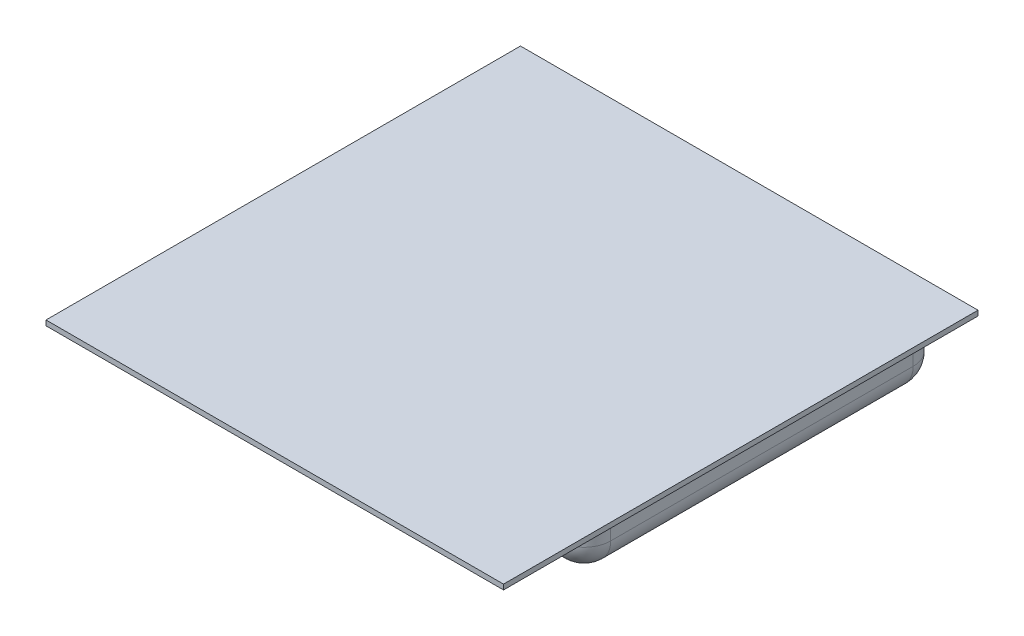
ISO-10303-21;
HEADER;
FILE_DESCRIPTION(('STEP AP214'),'2;1');
FILE_NAME('part.step','',(''),(''),'','','');
FILE_SCHEMA(('AUTOMOTIVE_DESIGN { 1 0 10303 214 1 1 1 1 }'));
ENDSEC;
DATA;
#1=APPLICATION_CONTEXT('core data for automotive mechanical design processes');
#2=APPLICATION_PROTOCOL_DEFINITION('international standard','automotive_design',2000,#1);
#3=PRODUCT_CONTEXT('',#1,'mechanical');
#4=PRODUCT('Part','Part','',(#3));
#5=PRODUCT_RELATED_PRODUCT_CATEGORY('part','',(#4));
#6=PRODUCT_DEFINITION_FORMATION('','',#4);
#7=PRODUCT_DEFINITION_CONTEXT('part definition',#1,'design');
#8=PRODUCT_DEFINITION('design','',#6,#7);
#9=PRODUCT_DEFINITION_SHAPE('','',#8);
#10=(LENGTH_UNIT() NAMED_UNIT(*) SI_UNIT(.MILLI.,.METRE.));
#11=(NAMED_UNIT(*) PLANE_ANGLE_UNIT() SI_UNIT($,.RADIAN.));
#12=(NAMED_UNIT(*) SI_UNIT($,.STERADIAN.) SOLID_ANGLE_UNIT());
#13=UNCERTAINTY_MEASURE_WITH_UNIT(LENGTH_MEASURE(1.E-05),#10,'distance_accuracy_value','');
#14=(GEOMETRIC_REPRESENTATION_CONTEXT(3) GLOBAL_UNCERTAINTY_ASSIGNED_CONTEXT((#13)) GLOBAL_UNIT_ASSIGNED_CONTEXT((#10,
#11,#12)) REPRESENTATION_CONTEXT('',''));
#15=CARTESIAN_POINT('',(0.,0.,0.));
#16=DIRECTION('',(0.,0.,1.));
#17=DIRECTION('',(1.,0.,0.));
#18=AXIS2_PLACEMENT_3D('',#15,#16,#17);
#19=CARTESIAN_POINT('',(-85.725,0.,88.9));
#20=DIRECTION('',(0.,1.,0.));
#21=DIRECTION('',(0.,0.,1.));
#22=AXIS2_PLACEMENT_3D('',#19,#20,#21);
#23=PLANE('',#22);
#24=DIRECTION('',(1.,0.,0.));
#25=VECTOR('',#24,1.);
#26=CARTESIAN_POINT('',(-85.725,0.,-88.9));
#27=LINE('',#26,#25);
#28=CARTESIAN_POINT('',(-85.725,0.,-88.9));
#29=VERTEX_POINT('',#28);
#30=CARTESIAN_POINT('',(85.725,0.,-88.9));
#31=VERTEX_POINT('',#30);
#32=EDGE_CURVE('E282',#29,#31,#27,.T.);
#33=ORIENTED_EDGE('',*,*,#32,.T.);
#34=DIRECTION('',(0.,0.,-1.));
#35=VECTOR('',#34,1.);
#36=CARTESIAN_POINT('',(85.725,0.,88.9));
#37=LINE('',#36,#35);
#38=CARTESIAN_POINT('',(85.725,0.,88.9));
#39=VERTEX_POINT('',#38);
#40=EDGE_CURVE('E152',#39,#31,#37,.T.);
#41=ORIENTED_EDGE('',*,*,#40,.F.);
#42=DIRECTION('',(1.,0.,0.));
#43=VECTOR('',#42,1.);
#44=CARTESIAN_POINT('',(-85.725,0.,88.9));
#45=LINE('',#44,#43);
#46=CARTESIAN_POINT('',(-85.725,0.,88.9));
#47=VERTEX_POINT('',#46);
#48=EDGE_CURVE('E145',#47,#39,#45,.T.);
#49=ORIENTED_EDGE('',*,*,#48,.F.);
#50=DIRECTION('',(0.,0.,-1.));
#51=VECTOR('',#50,1.);
#52=CARTESIAN_POINT('',(-85.725,0.,88.9));
#53=LINE('',#52,#51);
#54=EDGE_CURVE('E149',#47,#29,#53,.T.);
#55=ORIENTED_EDGE('',*,*,#54,.T.);
#56=EDGE_LOOP('',(#33,#41,#49,#55));
#57=FACE_BOUND('',#56,.T.);
#58=DIRECTION('',(0.,0.,-1.));
#59=VECTOR('',#58,1.);
#60=CARTESIAN_POINT('',(-77.7875,0.,50.8));
#61=LINE('',#60,#59);
#62=CARTESIAN_POINT('',(-77.7875,0.,40.8));
#63=VERTEX_POINT('',#62);
#64=CARTESIAN_POINT('',(-77.7875,0.,-72.55));
#65=VERTEX_POINT('',#64);
#66=EDGE_CURVE('E259',#63,#65,#61,.T.);
#67=ORIENTED_EDGE('',*,*,#66,.F.);
#68=CARTESIAN_POINT('',(-67.7875,0.,40.8));
#69=DIRECTION('',(0.,1.,0.));
#70=DIRECTION('',(0.,0.,1.));
#71=AXIS2_PLACEMENT_3D('',#68,#69,#70);
#72=CIRCLE('',#71,10.);
#73=CARTESIAN_POINT('',(-67.7875,0.,50.8));
#74=VERTEX_POINT('',#73);
#75=EDGE_CURVE('E202',#63,#74,#72,.T.);
#76=ORIENTED_EDGE('',*,*,#75,.T.);
#77=DIRECTION('',(-1.,0.,0.));
#78=VECTOR('',#77,1.);
#79=CARTESIAN_POINT('',(-77.7875,0.,50.8));
#80=LINE('',#79,#78);
#81=CARTESIAN_POINT('',(67.7875,0.,50.8));
#82=VERTEX_POINT('',#81);
#83=EDGE_CURVE('E275',#82,#74,#80,.T.);
#84=ORIENTED_EDGE('',*,*,#83,.F.);
#85=CARTESIAN_POINT('',(67.7875,0.,40.8));
#86=DIRECTION('',(0.,1.,0.));
#87=DIRECTION('',(0.,0.,1.));
#88=AXIS2_PLACEMENT_3D('',#85,#86,#87);
#89=CIRCLE('',#88,10.);
#90=CARTESIAN_POINT('',(77.7875,0.,40.8));
#91=VERTEX_POINT('',#90);
#92=EDGE_CURVE('E200',#82,#91,#89,.T.);
#93=ORIENTED_EDGE('',*,*,#92,.T.);
#94=DIRECTION('',(0.,0.,1.));
#95=VECTOR('',#94,1.);
#96=CARTESIAN_POINT('',(77.7875,0.,50.8));
#97=LINE('',#96,#95);
#98=CARTESIAN_POINT('',(77.7875,0.,-72.55));
#99=VERTEX_POINT('',#98);
#100=EDGE_CURVE('E270',#99,#91,#97,.T.);
#101=ORIENTED_EDGE('',*,*,#100,.F.);
#102=CARTESIAN_POINT('',(67.7875,0.,-72.55));
#103=DIRECTION('',(0.,1.,0.));
#104=DIRECTION('',(0.,0.,1.));
#105=AXIS2_PLACEMENT_3D('',#102,#103,#104);
#106=CIRCLE('',#105,10.);
#107=CARTESIAN_POINT('',(67.7875,0.,-82.55));
#108=VERTEX_POINT('',#107);
#109=EDGE_CURVE('E198',#99,#108,#106,.T.);
#110=ORIENTED_EDGE('',*,*,#109,.T.);
#111=DIRECTION('',(1.,0.,0.));
#112=VECTOR('',#111,1.);
#113=CARTESIAN_POINT('',(-77.7875,0.,-82.55));
#114=LINE('',#113,#112);
#115=CARTESIAN_POINT('',(-67.7875,0.,-82.55));
#116=VERTEX_POINT('',#115);
#117=EDGE_CURVE('E264',#116,#108,#114,.T.);
#118=ORIENTED_EDGE('',*,*,#117,.F.);
#119=CARTESIAN_POINT('',(-67.7875,0.,-72.55));
#120=DIRECTION('',(0.,1.,0.));
#121=DIRECTION('',(0.,0.,1.));
#122=AXIS2_PLACEMENT_3D('',#119,#120,#121);
#123=CIRCLE('',#122,10.);
#124=EDGE_CURVE('E196',#116,#65,#123,.T.);
#125=ORIENTED_EDGE('',*,*,#124,.T.);
#126=EDGE_LOOP('',(#67,#76,#84,#93,#101,#110,#118,#125));
#127=FACE_BOUND('',#126,.T.);
#128=ADVANCED_FACE('F38',(#57,#127),#23,.F.);
#129=CARTESIAN_POINT('',(-85.725,1.905,88.9));
#130=DIRECTION('',(1.,0.,0.));
#131=DIRECTION('',(0.,0.,-1.));
#132=AXIS2_PLACEMENT_3D('',#129,#130,#131);
#133=PLANE('',#132);
#134=DIRECTION('',(0.,-1.,0.));
#135=VECTOR('',#134,1.);
#136=CARTESIAN_POINT('',(-85.725,1.905,-88.9));
#137=LINE('',#136,#135);
#138=CARTESIAN_POINT('',(-85.725,1.905,-88.9));
#139=VERTEX_POINT('',#138);
#140=EDGE_CURVE('E169',#139,#29,#137,.T.);
#141=ORIENTED_EDGE('',*,*,#140,.T.);
#142=ORIENTED_EDGE('',*,*,#54,.F.);
#143=DIRECTION('',(0.,-1.,0.));
#144=VECTOR('',#143,1.);
#145=CARTESIAN_POINT('',(-85.725,1.905,88.9));
#146=LINE('',#145,#144);
#147=CARTESIAN_POINT('',(-85.725,1.905,88.9));
#148=VERTEX_POINT('',#147);
#149=EDGE_CURVE('E156',#148,#47,#146,.T.);
#150=ORIENTED_EDGE('',*,*,#149,.F.);
#151=DIRECTION('',(0.,0.,-1.));
#152=VECTOR('',#151,1.);
#153=CARTESIAN_POINT('',(-85.725,1.905,88.9));
#154=LINE('',#153,#152);
#155=EDGE_CURVE('E280',#148,#139,#154,.T.);
#156=ORIENTED_EDGE('',*,*,#155,.T.);
#157=EDGE_LOOP('',(#141,#142,#150,#156));
#158=FACE_BOUND('',#157,.T.);
#159=ADVANCED_FACE('F167',(#158),#133,.F.);
#160=CARTESIAN_POINT('',(85.725,1.905,88.9));
#161=DIRECTION('',(-1.,0.,0.));
#162=DIRECTION('',(0.,0.,1.));
#163=AXIS2_PLACEMENT_3D('',#160,#161,#162);
#164=PLANE('',#163);
#165=DIRECTION('',(0.,1.,0.));
#166=VECTOR('',#165,1.);
#167=CARTESIAN_POINT('',(85.725,1.905,-88.9));
#168=LINE('',#167,#166);
#169=CARTESIAN_POINT('',(85.725,1.905,-88.9));
#170=VERTEX_POINT('',#169);
#171=EDGE_CURVE('E285',#31,#170,#168,.T.);
#172=ORIENTED_EDGE('',*,*,#171,.T.);
#173=DIRECTION('',(0.,0.,-1.));
#174=VECTOR('',#173,1.);
#175=CARTESIAN_POINT('',(85.725,1.905,88.9));
#176=LINE('',#175,#174);
#177=CARTESIAN_POINT('',(85.725,1.905,88.9));
#178=VERTEX_POINT('',#177);
#179=EDGE_CURVE('E175',#178,#170,#176,.T.);
#180=ORIENTED_EDGE('',*,*,#179,.F.);
#181=DIRECTION('',(0.,1.,0.));
#182=VECTOR('',#181,1.);
#183=CARTESIAN_POINT('',(85.725,1.905,88.9));
#184=LINE('',#183,#182);
#185=EDGE_CURVE('E155',#39,#178,#184,.T.);
#186=ORIENTED_EDGE('',*,*,#185,.F.);
#187=ORIENTED_EDGE('',*,*,#40,.T.);
#188=EDGE_LOOP('',(#172,#180,#186,#187));
#189=FACE_BOUND('',#188,.T.);
#190=ADVANCED_FACE('F298',(#189),#164,.F.);
#191=CARTESIAN_POINT('',(-85.725,1.905,88.9));
#192=DIRECTION('',(0.,-1.,0.));
#193=DIRECTION('',(0.,0.,-1.));
#194=AXIS2_PLACEMENT_3D('',#191,#192,#193);
#195=PLANE('',#194);
#196=DIRECTION('',(-1.,0.,0.));
#197=VECTOR('',#196,1.);
#198=CARTESIAN_POINT('',(-85.725,1.905,-88.9));
#199=LINE('',#198,#197);
#200=EDGE_CURVE('E165',#170,#139,#199,.T.);
#201=ORIENTED_EDGE('',*,*,#200,.T.);
#202=ORIENTED_EDGE('',*,*,#155,.F.);
#203=DIRECTION('',(-1.,0.,0.));
#204=VECTOR('',#203,1.);
#205=CARTESIAN_POINT('',(-85.725,1.905,88.9));
#206=LINE('',#205,#204);
#207=EDGE_CURVE('E161',#178,#148,#206,.T.);
#208=ORIENTED_EDGE('',*,*,#207,.F.);
#209=ORIENTED_EDGE('',*,*,#179,.T.);
#210=EDGE_LOOP('',(#201,#202,#208,#209));
#211=FACE_BOUND('',#210,.T.);
#212=ADVANCED_FACE('F293',(#211),#195,.F.);
#213=CARTESIAN_POINT('',(-85.725,0.,88.9));
#214=DIRECTION('',(0.,0.,1.));
#215=DIRECTION('',(1.,0.,0.));
#216=AXIS2_PLACEMENT_3D('',#213,#214,#215);
#217=PLANE('',#216);
#218=ORIENTED_EDGE('',*,*,#149,.T.);
#219=ORIENTED_EDGE('',*,*,#48,.T.);
#220=ORIENTED_EDGE('',*,*,#185,.T.);
#221=ORIENTED_EDGE('',*,*,#207,.T.);
#222=EDGE_LOOP('',(#218,#219,#220,#221));
#223=FACE_BOUND('',#222,.T.);
#224=ADVANCED_FACE('F159',(#223),#217,.T.);
#225=CARTESIAN_POINT('',(-85.725,0.,-88.9));
#226=DIRECTION('',(0.,0.,1.));
#227=DIRECTION('',(1.,0.,0.));
#228=AXIS2_PLACEMENT_3D('',#225,#226,#227);
#229=PLANE('',#228);
#230=ORIENTED_EDGE('',*,*,#140,.F.);
#231=ORIENTED_EDGE('',*,*,#200,.F.);
#232=ORIENTED_EDGE('',*,*,#171,.F.);
#233=ORIENTED_EDGE('',*,*,#32,.F.);
#234=EDGE_LOOP('',(#230,#231,#232,#233));
#235=FACE_BOUND('',#234,.T.);
#236=ADVANCED_FACE('F297',(#235),#229,.F.);
#237=CARTESIAN_POINT('',(-77.7875,-22.1,50.8));
#238=DIRECTION('',(1.,0.,0.));
#239=DIRECTION('',(0.,0.,-1.));
#240=AXIS2_PLACEMENT_3D('',#237,#238,#239);
#241=PLANE('',#240);
#242=DIRECTION('',(0.,1.,0.));
#243=VECTOR('',#242,1.);
#244=CARTESIAN_POINT('',(-77.7875,-22.1,-72.55));
#245=LINE('',#244,#243);
#246=CARTESIAN_POINT('',(-77.7875,-12.1,-72.55));
#247=VERTEX_POINT('',#246);
#248=EDGE_CURVE('E182',#65,#247,#245,.F.);
#249=ORIENTED_EDGE('',*,*,#248,.T.);
#250=DIRECTION('',(0.,0.,-1.));
#251=VECTOR('',#250,1.);
#252=CARTESIAN_POINT('',(-77.7875,-12.1,40.8));
#253=LINE('',#252,#251);
#254=CARTESIAN_POINT('',(-77.7875,-12.1,40.8));
#255=VERTEX_POINT('',#254);
#256=EDGE_CURVE('E11',#247,#255,#253,.F.);
#257=ORIENTED_EDGE('',*,*,#256,.T.);
#258=DIRECTION('',(0.,1.,0.));
#259=VECTOR('',#258,1.);
#260=CARTESIAN_POINT('',(-77.7875,-22.1,40.8));
#261=LINE('',#260,#259);
#262=EDGE_CURVE('E180',#255,#63,#261,.T.);
#263=ORIENTED_EDGE('',*,*,#262,.T.);
#264=ORIENTED_EDGE('',*,*,#66,.T.);
#265=EDGE_LOOP('',(#249,#257,#263,#264));
#266=FACE_BOUND('',#265,.T.);
#267=ADVANCED_FACE('F365',(#266),#241,.F.);
#268=CARTESIAN_POINT('',(-77.7875,-22.1,-82.55));
#269=DIRECTION('',(0.,0.,1.));
#270=DIRECTION('',(1.,0.,0.));
#271=AXIS2_PLACEMENT_3D('',#268,#269,#270);
#272=PLANE('',#271);
#273=DIRECTION('',(0.,1.,0.));
#274=VECTOR('',#273,1.);
#275=CARTESIAN_POINT('',(67.7875,-22.1,-82.55));
#276=LINE('',#275,#274);
#277=CARTESIAN_POINT('',(67.7875,-12.1,-82.55));
#278=VERTEX_POINT('',#277);
#279=EDGE_CURVE('E170',#108,#278,#276,.F.);
#280=ORIENTED_EDGE('',*,*,#279,.T.);
#281=DIRECTION('',(1.,0.,0.));
#282=VECTOR('',#281,1.);
#283=CARTESIAN_POINT('',(-67.7875,-12.1,-82.55));
#284=LINE('',#283,#282);
#285=CARTESIAN_POINT('',(-67.7875,-12.1,-82.55));
#286=VERTEX_POINT('',#285);
#287=EDGE_CURVE('E62',#278,#286,#284,.F.);
#288=ORIENTED_EDGE('',*,*,#287,.T.);
#289=DIRECTION('',(0.,1.,0.));
#290=VECTOR('',#289,1.);
#291=CARTESIAN_POINT('',(-67.7875,-22.1,-82.55));
#292=LINE('',#291,#290);
#293=EDGE_CURVE('E172',#286,#116,#292,.T.);
#294=ORIENTED_EDGE('',*,*,#293,.T.);
#295=ORIENTED_EDGE('',*,*,#117,.T.);
#296=EDGE_LOOP('',(#280,#288,#294,#295));
#297=FACE_BOUND('',#296,.T.);
#298=ADVANCED_FACE('F389',(#297),#272,.F.);
#299=CARTESIAN_POINT('',(77.7875,-22.1,50.8));
#300=DIRECTION('',(-1.,0.,0.));
#301=DIRECTION('',(0.,0.,1.));
#302=AXIS2_PLACEMENT_3D('',#299,#300,#301);
#303=PLANE('',#302);
#304=DIRECTION('',(0.,1.,0.));
#305=VECTOR('',#304,1.);
#306=CARTESIAN_POINT('',(77.7875,-22.1,40.8));
#307=LINE('',#306,#305);
#308=CARTESIAN_POINT('',(77.7875,-12.1,40.8));
#309=VERTEX_POINT('',#308);
#310=EDGE_CURVE('E184',#91,#309,#307,.F.);
#311=ORIENTED_EDGE('',*,*,#310,.T.);
#312=DIRECTION('',(0.,0.,1.));
#313=VECTOR('',#312,1.);
#314=CARTESIAN_POINT('',(77.7875,-12.1,-72.55));
#315=LINE('',#314,#313);
#316=CARTESIAN_POINT('',(77.7875,-12.1,-72.55));
#317=VERTEX_POINT('',#316);
#318=EDGE_CURVE('E225',#309,#317,#315,.F.);
#319=ORIENTED_EDGE('',*,*,#318,.T.);
#320=DIRECTION('',(0.,1.,0.));
#321=VECTOR('',#320,1.);
#322=CARTESIAN_POINT('',(77.7875,-22.1,-72.55));
#323=LINE('',#322,#321);
#324=EDGE_CURVE('E188',#317,#99,#323,.T.);
#325=ORIENTED_EDGE('',*,*,#324,.T.);
#326=ORIENTED_EDGE('',*,*,#100,.T.);
#327=EDGE_LOOP('',(#311,#319,#325,#326));
#328=FACE_BOUND('',#327,.T.);
#329=ADVANCED_FACE('F383',(#328),#303,.F.);
#330=CARTESIAN_POINT('',(-77.7875,-22.1,50.8));
#331=DIRECTION('',(0.,0.,-1.));
#332=DIRECTION('',(-1.,0.,0.));
#333=AXIS2_PLACEMENT_3D('',#330,#331,#332);
#334=PLANE('',#333);
#335=DIRECTION('',(0.,1.,0.));
#336=VECTOR('',#335,1.);
#337=CARTESIAN_POINT('',(-67.7875,-22.1,50.8));
#338=LINE('',#337,#336);
#339=CARTESIAN_POINT('',(-67.7875,-12.1,50.8));
#340=VERTEX_POINT('',#339);
#341=EDGE_CURVE('E190',#74,#340,#338,.F.);
#342=ORIENTED_EDGE('',*,*,#341,.T.);
#343=DIRECTION('',(-1.,0.,0.));
#344=VECTOR('',#343,1.);
#345=CARTESIAN_POINT('',(67.7875,-12.1,50.8));
#346=LINE('',#345,#344);
#347=CARTESIAN_POINT('',(67.7875,-12.1,50.8));
#348=VERTEX_POINT('',#347);
#349=EDGE_CURVE('E219',#340,#348,#346,.F.);
#350=ORIENTED_EDGE('',*,*,#349,.T.);
#351=DIRECTION('',(0.,1.,0.));
#352=VECTOR('',#351,1.);
#353=CARTESIAN_POINT('',(67.7875,-22.1,50.8));
#354=LINE('',#353,#352);
#355=EDGE_CURVE('E193',#348,#82,#354,.T.);
#356=ORIENTED_EDGE('',*,*,#355,.T.);
#357=ORIENTED_EDGE('',*,*,#83,.T.);
#358=EDGE_LOOP('',(#342,#350,#356,#357));
#359=FACE_BOUND('',#358,.T.);
#360=ADVANCED_FACE('F375',(#359),#334,.F.);
#361=CARTESIAN_POINT('',(-77.7875,-22.1,-82.55));
#362=DIRECTION('',(0.,-1.,0.));
#363=DIRECTION('',(0.,0.,-1.));
#364=AXIS2_PLACEMENT_3D('',#361,#362,#363);
#365=PLANE('',#364);
#366=DIRECTION('',(0.,0.,1.));
#367=VECTOR('',#366,1.);
#368=CARTESIAN_POINT('',(67.7875,-22.1,40.8));
#369=LINE('',#368,#367);
#370=CARTESIAN_POINT('',(67.7875,-22.1,-72.55));
#371=VERTEX_POINT('',#370);
#372=CARTESIAN_POINT('',(67.7875,-22.1,40.8));
#373=VERTEX_POINT('',#372);
#374=EDGE_CURVE('E212',#371,#373,#369,.T.);
#375=ORIENTED_EDGE('',*,*,#374,.T.);
#376=DIRECTION('',(-1.,0.,0.));
#377=VECTOR('',#376,1.);
#378=CARTESIAN_POINT('',(-67.7875,-22.1,40.8));
#379=LINE('',#378,#377);
#380=CARTESIAN_POINT('',(-67.7875,-22.1,40.8));
#381=VERTEX_POINT('',#380);
#382=EDGE_CURVE('E215',#373,#381,#379,.T.);
#383=ORIENTED_EDGE('',*,*,#382,.T.);
#384=DIRECTION('',(0.,0.,-1.));
#385=VECTOR('',#384,1.);
#386=CARTESIAN_POINT('',(-67.7875,-22.1,-72.55));
#387=LINE('',#386,#385);
#388=CARTESIAN_POINT('',(-67.7875,-22.1,-72.55));
#389=VERTEX_POINT('',#388);
#390=EDGE_CURVE('E207',#381,#389,#387,.T.);
#391=ORIENTED_EDGE('',*,*,#390,.T.);
#392=DIRECTION('',(1.,0.,0.));
#393=VECTOR('',#392,1.);
#394=CARTESIAN_POINT('',(67.7875,-22.1,-72.55));
#395=LINE('',#394,#393);
#396=EDGE_CURVE('E209',#389,#371,#395,.T.);
#397=ORIENTED_EDGE('',*,*,#396,.T.);
#398=EDGE_LOOP('',(#375,#383,#391,#397));
#399=FACE_BOUND('',#398,.T.);
#400=ADVANCED_FACE('F316',(#399),#365,.T.);
#401=CARTESIAN_POINT('',(-67.7875,-22.1,-72.55));
#402=DIRECTION('',(0.,1.,0.));
#403=DIRECTION('',(0.,0.,1.));
#404=AXIS2_PLACEMENT_3D('',#401,#402,#403);
#405=CYLINDRICAL_SURFACE('',#404,10.);
#406=ORIENTED_EDGE('',*,*,#293,.F.);
#407=CARTESIAN_POINT('',(-67.7875,-12.1,-72.55));
#408=DIRECTION('',(0.,1.,0.));
#409=DIRECTION('',(0.,0.,1.));
#410=AXIS2_PLACEMENT_3D('',#407,#408,#409);
#411=CIRCLE('',#410,10.);
#412=EDGE_CURVE('E47',#286,#247,#411,.T.);
#413=ORIENTED_EDGE('',*,*,#412,.T.);
#414=ORIENTED_EDGE('',*,*,#248,.F.);
#415=ORIENTED_EDGE('',*,*,#124,.F.);
#416=EDGE_LOOP('',(#406,#413,#414,#415));
#417=FACE_BOUND('',#416,.T.);
#418=ADVANCED_FACE('F312',(#417),#405,.T.);
#419=CARTESIAN_POINT('',(67.7875,-22.1,-72.55));
#420=DIRECTION('',(0.,1.,0.));
#421=DIRECTION('',(0.,0.,1.));
#422=AXIS2_PLACEMENT_3D('',#419,#420,#421);
#423=CYLINDRICAL_SURFACE('',#422,10.);
#424=ORIENTED_EDGE('',*,*,#324,.F.);
#425=CARTESIAN_POINT('',(67.7875,-12.1,-72.55));
#426=DIRECTION('',(0.,1.,0.));
#427=DIRECTION('',(0.,0.,1.));
#428=AXIS2_PLACEMENT_3D('',#425,#426,#427);
#429=CIRCLE('',#428,10.);
#430=EDGE_CURVE('E228',#317,#278,#429,.T.);
#431=ORIENTED_EDGE('',*,*,#430,.T.);
#432=ORIENTED_EDGE('',*,*,#279,.F.);
#433=ORIENTED_EDGE('',*,*,#109,.F.);
#434=EDGE_LOOP('',(#424,#431,#432,#433));
#435=FACE_BOUND('',#434,.T.);
#436=ADVANCED_FACE('F315',(#435),#423,.T.);
#437=CARTESIAN_POINT('',(67.7875,-22.1,40.8));
#438=DIRECTION('',(0.,1.,0.));
#439=DIRECTION('',(0.,0.,1.));
#440=AXIS2_PLACEMENT_3D('',#437,#438,#439);
#441=CYLINDRICAL_SURFACE('',#440,10.);
#442=ORIENTED_EDGE('',*,*,#355,.F.);
#443=CARTESIAN_POINT('',(67.7875,-12.1,40.8));
#444=DIRECTION('',(0.,1.,0.));
#445=DIRECTION('',(0.,0.,1.));
#446=AXIS2_PLACEMENT_3D('',#443,#444,#445);
#447=CIRCLE('',#446,10.);
#448=EDGE_CURVE('E222',#348,#309,#447,.T.);
#449=ORIENTED_EDGE('',*,*,#448,.T.);
#450=ORIENTED_EDGE('',*,*,#310,.F.);
#451=ORIENTED_EDGE('',*,*,#92,.F.);
#452=EDGE_LOOP('',(#442,#449,#450,#451));
#453=FACE_BOUND('',#452,.T.);
#454=ADVANCED_FACE('F319',(#453),#441,.T.);
#455=CARTESIAN_POINT('',(-67.7875,-22.1,40.8));
#456=DIRECTION('',(0.,1.,0.));
#457=DIRECTION('',(0.,0.,1.));
#458=AXIS2_PLACEMENT_3D('',#455,#456,#457);
#459=CYLINDRICAL_SURFACE('',#458,10.);
#460=ORIENTED_EDGE('',*,*,#262,.F.);
#461=CARTESIAN_POINT('',(-67.7875,-12.1,40.8));
#462=DIRECTION('',(0.,1.,0.));
#463=DIRECTION('',(0.,0.,1.));
#464=AXIS2_PLACEMENT_3D('',#461,#462,#463);
#465=CIRCLE('',#464,10.);
#466=EDGE_CURVE('E204',#255,#340,#465,.T.);
#467=ORIENTED_EDGE('',*,*,#466,.T.);
#468=ORIENTED_EDGE('',*,*,#341,.F.);
#469=ORIENTED_EDGE('',*,*,#75,.F.);
#470=EDGE_LOOP('',(#460,#467,#468,#469));
#471=FACE_BOUND('',#470,.T.);
#472=ADVANCED_FACE('F323',(#471),#459,.T.);
#473=CARTESIAN_POINT('',(67.7875,-12.1,-72.55));
#474=DIRECTION('',(0.,0.,1.));
#475=DIRECTION('',(1.,0.,0.));
#476=AXIS2_PLACEMENT_3D('',#473,#474,#475);
#477=SPHERICAL_SURFACE('',#476,10.);
#478=CARTESIAN_POINT('',(67.7875,-12.1,-72.55));
#479=DIRECTION('',(-1.,0.,0.));
#480=DIRECTION('',(0.,0.,1.));
#481=AXIS2_PLACEMENT_3D('',#478,#479,#480);
#482=CIRCLE('',#481,10.);
#483=EDGE_CURVE('E250',#278,#371,#482,.T.);
#484=ORIENTED_EDGE('',*,*,#483,.F.);
#485=ORIENTED_EDGE('',*,*,#430,.F.);
#486=CARTESIAN_POINT('',(67.7875,-12.1,-72.55));
#487=DIRECTION('',(0.,0.,1.));
#488=DIRECTION('',(1.,0.,0.));
#489=AXIS2_PLACEMENT_3D('',#486,#487,#488);
#490=CIRCLE('',#489,10.);
#491=EDGE_CURVE('E42',#371,#317,#490,.T.);
#492=ORIENTED_EDGE('',*,*,#491,.F.);
#493=EDGE_LOOP('',(#484,#485,#492));
#494=FACE_BOUND('',#493,.T.);
#495=ADVANCED_FACE('F40',(#494),#477,.T.);
#496=CARTESIAN_POINT('',(67.7875,-12.1,-82.55));
#497=DIRECTION('',(0.,0.,-1.));
#498=DIRECTION('',(-1.,0.,0.));
#499=AXIS2_PLACEMENT_3D('',#496,#497,#498);
#500=CYLINDRICAL_SURFACE('',#499,10.);
#501=ORIENTED_EDGE('',*,*,#491,.T.);
#502=ORIENTED_EDGE('',*,*,#318,.F.);
#503=CARTESIAN_POINT('',(67.7875,-12.1,40.8));
#504=DIRECTION('',(0.,0.,1.));
#505=DIRECTION('',(1.,0.,0.));
#506=AXIS2_PLACEMENT_3D('',#503,#504,#505);
#507=CIRCLE('',#506,10.);
#508=EDGE_CURVE('E247',#373,#309,#507,.T.);
#509=ORIENTED_EDGE('',*,*,#508,.F.);
#510=ORIENTED_EDGE('',*,*,#374,.F.);
#511=EDGE_LOOP('',(#501,#502,#509,#510));
#512=FACE_BOUND('',#511,.T.);
#513=ADVANCED_FACE('F350',(#512),#500,.T.);
#514=CARTESIAN_POINT('',(-77.7875,-12.1,-72.55));
#515=DIRECTION('',(-1.,0.,0.));
#516=DIRECTION('',(0.,0.,1.));
#517=AXIS2_PLACEMENT_3D('',#514,#515,#516);
#518=CYLINDRICAL_SURFACE('',#517,10.);
#519=ORIENTED_EDGE('',*,*,#483,.T.);
#520=ORIENTED_EDGE('',*,*,#396,.F.);
#521=CARTESIAN_POINT('',(-67.7875,-12.1,-72.55));
#522=DIRECTION('',(-1.,0.,0.));
#523=DIRECTION('',(0.,0.,1.));
#524=AXIS2_PLACEMENT_3D('',#521,#522,#523);
#525=CIRCLE('',#524,10.);
#526=EDGE_CURVE('E244',#286,#389,#525,.T.);
#527=ORIENTED_EDGE('',*,*,#526,.F.);
#528=ORIENTED_EDGE('',*,*,#287,.F.);
#529=EDGE_LOOP('',(#519,#520,#527,#528));
#530=FACE_BOUND('',#529,.T.);
#531=ADVANCED_FACE('F347',(#530),#518,.T.);
#532=CARTESIAN_POINT('',(67.7875,-12.1,40.8));
#533=DIRECTION('',(0.,0.,1.));
#534=DIRECTION('',(1.,0.,0.));
#535=AXIS2_PLACEMENT_3D('',#532,#533,#534);
#536=SPHERICAL_SURFACE('',#535,10.);
#537=ORIENTED_EDGE('',*,*,#508,.T.);
#538=ORIENTED_EDGE('',*,*,#448,.F.);
#539=CARTESIAN_POINT('',(67.7875,-12.1,40.8));
#540=DIRECTION('',(-1.,0.,0.));
#541=DIRECTION('',(0.,0.,1.));
#542=AXIS2_PLACEMENT_3D('',#539,#540,#541);
#543=CIRCLE('',#542,10.);
#544=EDGE_CURVE('E240',#373,#348,#543,.T.);
#545=ORIENTED_EDGE('',*,*,#544,.F.);
#546=EDGE_LOOP('',(#537,#538,#545));
#547=FACE_BOUND('',#546,.T.);
#548=ADVANCED_FACE('F343',(#547),#536,.T.);
#549=CARTESIAN_POINT('',(-67.7875,-12.1,-72.55));
#550=DIRECTION('',(0.,0.,1.));
#551=DIRECTION('',(1.,0.,0.));
#552=AXIS2_PLACEMENT_3D('',#549,#550,#551);
#553=SPHERICAL_SURFACE('',#552,10.);
#554=ORIENTED_EDGE('',*,*,#412,.F.);
#555=ORIENTED_EDGE('',*,*,#526,.T.);
#556=CARTESIAN_POINT('',(-67.7875,-12.1,-72.55));
#557=DIRECTION('',(0.,0.,1.));
#558=DIRECTION('',(1.,0.,0.));
#559=AXIS2_PLACEMENT_3D('',#556,#557,#558);
#560=CIRCLE('',#559,10.);
#561=EDGE_CURVE('E237',#247,#389,#560,.T.);
#562=ORIENTED_EDGE('',*,*,#561,.F.);
#563=EDGE_LOOP('',(#554,#555,#562));
#564=FACE_BOUND('',#563,.T.);
#565=ADVANCED_FACE('F339',(#564),#553,.T.);
#566=CARTESIAN_POINT('',(-77.7875,-12.1,40.8));
#567=DIRECTION('',(1.,0.,0.));
#568=DIRECTION('',(0.,0.,-1.));
#569=AXIS2_PLACEMENT_3D('',#566,#567,#568);
#570=CYLINDRICAL_SURFACE('',#569,10.);
#571=ORIENTED_EDGE('',*,*,#544,.T.);
#572=ORIENTED_EDGE('',*,*,#349,.F.);
#573=CARTESIAN_POINT('',(-67.7875,-12.1,40.8));
#574=DIRECTION('',(-1.,0.,0.));
#575=DIRECTION('',(0.,0.,1.));
#576=AXIS2_PLACEMENT_3D('',#573,#574,#575);
#577=CIRCLE('',#576,10.);
#578=EDGE_CURVE('E235',#381,#340,#577,.T.);
#579=ORIENTED_EDGE('',*,*,#578,.F.);
#580=ORIENTED_EDGE('',*,*,#382,.F.);
#581=EDGE_LOOP('',(#571,#572,#579,#580));
#582=FACE_BOUND('',#581,.T.);
#583=ADVANCED_FACE('F335',(#582),#570,.T.);
#584=CARTESIAN_POINT('',(-67.7875,-12.1,-82.55));
#585=DIRECTION('',(0.,0.,1.));
#586=DIRECTION('',(1.,0.,0.));
#587=AXIS2_PLACEMENT_3D('',#584,#585,#586);
#588=CYLINDRICAL_SURFACE('',#587,10.);
#589=ORIENTED_EDGE('',*,*,#561,.T.);
#590=ORIENTED_EDGE('',*,*,#390,.F.);
#591=CARTESIAN_POINT('',(-67.7875,-12.1,40.8));
#592=DIRECTION('',(0.,0.,1.));
#593=DIRECTION('',(1.,0.,0.));
#594=AXIS2_PLACEMENT_3D('',#591,#592,#593);
#595=CIRCLE('',#594,10.);
#596=EDGE_CURVE('E233',#255,#381,#595,.T.);
#597=ORIENTED_EDGE('',*,*,#596,.F.);
#598=ORIENTED_EDGE('',*,*,#256,.F.);
#599=EDGE_LOOP('',(#589,#590,#597,#598));
#600=FACE_BOUND('',#599,.T.);
#601=ADVANCED_FACE('F331',(#600),#588,.T.);
#602=CARTESIAN_POINT('',(-67.7875,-12.1,40.8));
#603=DIRECTION('',(0.,0.,1.));
#604=DIRECTION('',(1.,0.,0.));
#605=AXIS2_PLACEMENT_3D('',#602,#603,#604);
#606=SPHERICAL_SURFACE('',#605,10.);
#607=ORIENTED_EDGE('',*,*,#578,.T.);
#608=ORIENTED_EDGE('',*,*,#466,.F.);
#609=ORIENTED_EDGE('',*,*,#596,.T.);
#610=EDGE_LOOP('',(#607,#608,#609));
#611=FACE_BOUND('',#610,.T.);
#612=ADVANCED_FACE('F328',(#611),#606,.T.);
#613=CLOSED_SHELL('',(#128,#159,#190,#212,#224,#236,#267,#298,#329,#360,#400,#418,#436,#454,
#472,#495,#513,#531,#548,#565,#583,#601,#612));
#614=MANIFOLD_SOLID_BREP('B2',#613);
#615=ADVANCED_BREP_SHAPE_REPRESENTATION('',(#18,#614),#14);
#616=SHAPE_DEFINITION_REPRESENTATION(#9,#615);
ENDSEC;
END-ISO-10303-21;
